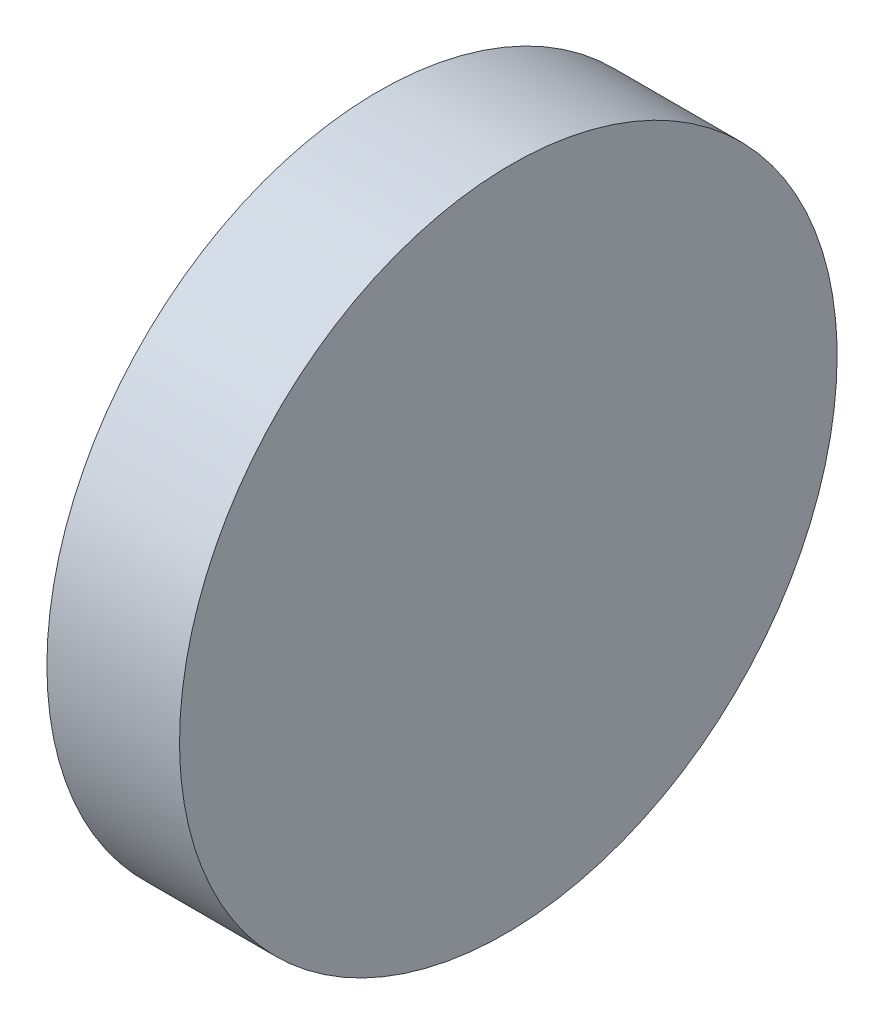
ISO-10303-21;
HEADER;
FILE_DESCRIPTION(('STEP AP214'),'2;1');
FILE_NAME('part.step','',(''),(''),'','','');
FILE_SCHEMA(('AUTOMOTIVE_DESIGN { 1 0 10303 214 1 1 1 1 }'));
ENDSEC;
DATA;
#1=APPLICATION_CONTEXT('core data for automotive mechanical design processes');
#2=APPLICATION_PROTOCOL_DEFINITION('international standard','automotive_design',2000,#1);
#3=PRODUCT_CONTEXT('',#1,'mechanical');
#4=PRODUCT('Part','Part','',(#3));
#5=PRODUCT_RELATED_PRODUCT_CATEGORY('part','',(#4));
#6=PRODUCT_DEFINITION_FORMATION('','',#4);
#7=PRODUCT_DEFINITION_CONTEXT('part definition',#1,'design');
#8=PRODUCT_DEFINITION('design','',#6,#7);
#9=PRODUCT_DEFINITION_SHAPE('','',#8);
#10=(LENGTH_UNIT() NAMED_UNIT(*) SI_UNIT(.MILLI.,.METRE.));
#11=(NAMED_UNIT(*) PLANE_ANGLE_UNIT() SI_UNIT($,.RADIAN.));
#12=(NAMED_UNIT(*) SI_UNIT($,.STERADIAN.) SOLID_ANGLE_UNIT());
#13=UNCERTAINTY_MEASURE_WITH_UNIT(LENGTH_MEASURE(1.E-05),#10,'distance_accuracy_value','');
#14=(GEOMETRIC_REPRESENTATION_CONTEXT(3) GLOBAL_UNCERTAINTY_ASSIGNED_CONTEXT((#13)) GLOBAL_UNIT_ASSIGNED_CONTEXT((#10,
#11,#12)) REPRESENTATION_CONTEXT('',''));
#15=CARTESIAN_POINT('',(0.,0.,0.));
#16=DIRECTION('',(0.,0.,1.));
#17=DIRECTION('',(1.,0.,0.));
#18=AXIS2_PLACEMENT_3D('',#15,#16,#17);
#19=CARTESIAN_POINT('',(0.,25.,-12.5));
#20=DIRECTION('',(1.,0.,0.));
#21=DIRECTION('',(0.,0.,-1.));
#22=AXIS2_PLACEMENT_3D('',#19,#20,#21);
#23=PLANE('',#22);
#24=CARTESIAN_POINT('',(0.,12.5,0.));
#25=DIRECTION('',(-1.,0.,0.));
#26=DIRECTION('',(0.,0.,1.));
#27=AXIS2_PLACEMENT_3D('',#24,#25,#26);
#28=CIRCLE('',#27,12.5);
#29=CARTESIAN_POINT('',(0.,12.5,12.5));
#30=VERTEX_POINT('',#29);
#31=EDGE_CURVE('E39',#30,#30,#28,.T.);
#32=ORIENTED_EDGE('',*,*,#31,.T.);
#33=EDGE_LOOP('',(#32));
#34=FACE_BOUND('',#33,.T.);
#35=ADVANCED_FACE('F33',(#34),#23,.F.);
#36=CARTESIAN_POINT('',(5.,25.,12.5));
#37=DIRECTION('',(-0.999961923064171,0.,0.00872653549836698));
#38=DIRECTION('',(0.00872653549836698,0.,0.999961923064171));
#39=AXIS2_PLACEMENT_3D('',#36,#37,#38);
#40=PLANE('',#39);
#41=CARTESIAN_POINT('',(4.89091415261561,12.5,0.));
#42=DIRECTION('',(-0.999961923064171,0.,0.00872653549836698));
#43=DIRECTION('',(-0.00872653549836698,0.,-0.999961923064171));
#44=AXIS2_PLACEMENT_3D('',#41,#42,#43);
#45=ELLIPSE('',#44,12.5004759798217,12.5);
#46=CARTESIAN_POINT('',(4.78182830523121,12.5,-12.5));
#47=VERTEX_POINT('',#46);
#48=EDGE_CURVE('E10',#47,#47,#45,.T.);
#49=ORIENTED_EDGE('',*,*,#48,.F.);
#50=EDGE_LOOP('',(#49));
#51=FACE_BOUND('',#50,.T.);
#52=ADVANCED_FACE('F48',(#51),#40,.F.);
#53=CARTESIAN_POINT('',(12.5,12.5,0.));
#54=DIRECTION('',(-1.,0.,0.));
#55=DIRECTION('',(0.,0.,1.));
#56=AXIS2_PLACEMENT_3D('',#53,#54,#55);
#57=CYLINDRICAL_SURFACE('',#56,12.5);
#58=ORIENTED_EDGE('',*,*,#31,.F.);
#59=EDGE_LOOP('',(#58));
#60=FACE_BOUND('',#59,.T.);
#61=ORIENTED_EDGE('',*,*,#48,.T.);
#62=EDGE_LOOP('',(#61));
#63=FACE_BOUND('',#62,.T.);
#64=ADVANCED_FACE('F46',(#60,#63),#57,.T.);
#65=CLOSED_SHELL('',(#35,#52,#64));
#66=MANIFOLD_SOLID_BREP('B2',#65);
#67=ADVANCED_BREP_SHAPE_REPRESENTATION('',(#18,#66),#14);
#68=SHAPE_DEFINITION_REPRESENTATION(#9,#67);
ENDSEC;
END-ISO-10303-21;
